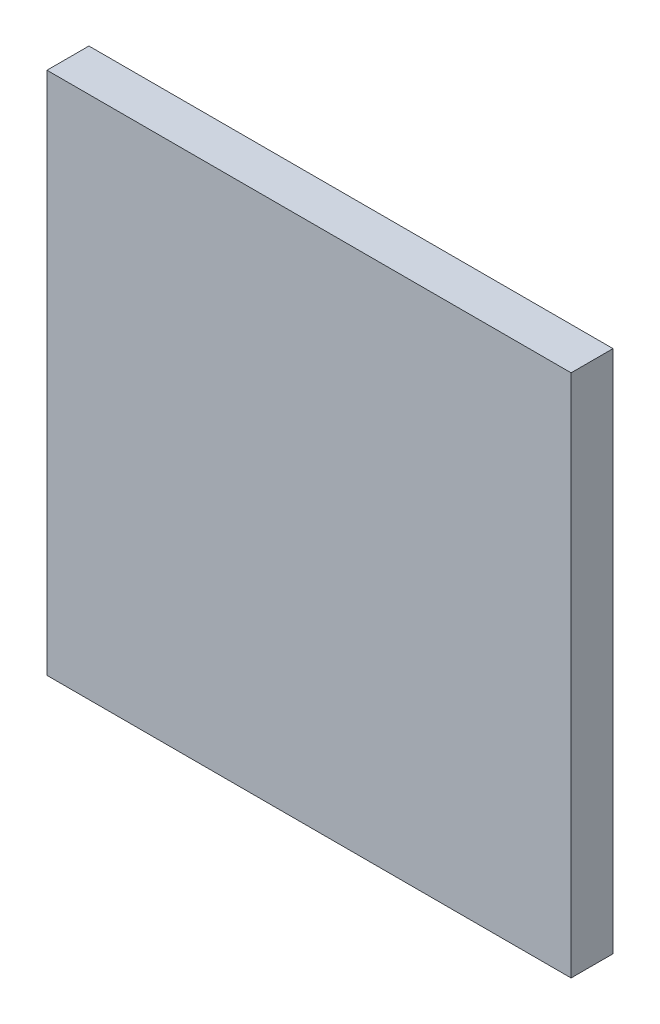
ISO-10303-21;
HEADER;
FILE_DESCRIPTION(('STEP AP214'),'2;1');
FILE_NAME('part.step','',(''),(''),'','','');
FILE_SCHEMA(('AUTOMOTIVE_DESIGN { 1 0 10303 214 1 1 1 1 }'));
ENDSEC;
DATA;
#1=APPLICATION_CONTEXT('core data for automotive mechanical design processes');
#2=APPLICATION_PROTOCOL_DEFINITION('international standard','automotive_design',2000,#1);
#3=PRODUCT_CONTEXT('',#1,'mechanical');
#4=PRODUCT('Part','Part','',(#3));
#5=PRODUCT_RELATED_PRODUCT_CATEGORY('part','',(#4));
#6=PRODUCT_DEFINITION_FORMATION('','',#4);
#7=PRODUCT_DEFINITION_CONTEXT('part definition',#1,'design');
#8=PRODUCT_DEFINITION('design','',#6,#7);
#9=PRODUCT_DEFINITION_SHAPE('','',#8);
#10=(LENGTH_UNIT() NAMED_UNIT(*) SI_UNIT(.MILLI.,.METRE.));
#11=(NAMED_UNIT(*) PLANE_ANGLE_UNIT() SI_UNIT($,.RADIAN.));
#12=(NAMED_UNIT(*) SI_UNIT($,.STERADIAN.) SOLID_ANGLE_UNIT());
#13=UNCERTAINTY_MEASURE_WITH_UNIT(LENGTH_MEASURE(1.E-05),#10,'distance_accuracy_value','');
#14=(GEOMETRIC_REPRESENTATION_CONTEXT(3) GLOBAL_UNCERTAINTY_ASSIGNED_CONTEXT((#13)) GLOBAL_UNIT_ASSIGNED_CONTEXT((#10,
#11,#12)) REPRESENTATION_CONTEXT('',''));
#15=CARTESIAN_POINT('',(0.,0.,0.));
#16=DIRECTION('',(0.,0.,1.));
#17=DIRECTION('',(1.,0.,0.));
#18=AXIS2_PLACEMENT_3D('',#15,#16,#17);
#19=CARTESIAN_POINT('',(466.617543457686,129.384302534264,4.));
#20=DIRECTION('',(0.,1.,0.));
#21=DIRECTION('',(0.,0.,1.));
#22=AXIS2_PLACEMENT_3D('',#19,#20,#21);
#23=PLANE('',#22);
#24=DIRECTION('',(1.,0.,0.));
#25=VECTOR('',#24,1.);
#26=CARTESIAN_POINT('',(466.617543457686,129.384302534264,0.));
#27=LINE('',#26,#25);
#28=CARTESIAN_POINT('',(416.617543457686,129.384302534264,0.));
#29=VERTEX_POINT('',#28);
#30=CARTESIAN_POINT('',(466.617543457686,129.384302534264,0.));
#31=VERTEX_POINT('',#30);
#32=EDGE_CURVE('E91',#29,#31,#27,.T.);
#33=ORIENTED_EDGE('',*,*,#32,.T.);
#34=DIRECTION('',(0.,0.,-1.));
#35=VECTOR('',#34,1.);
#36=CARTESIAN_POINT('',(466.617543457686,129.384302534264,4.));
#37=LINE('',#36,#35);
#38=CARTESIAN_POINT('',(466.617543457686,129.384302534264,4.));
#39=VERTEX_POINT('',#38);
#40=EDGE_CURVE('E45',#39,#31,#37,.T.);
#41=ORIENTED_EDGE('',*,*,#40,.F.);
#42=DIRECTION('',(1.,0.,0.));
#43=VECTOR('',#42,1.);
#44=CARTESIAN_POINT('',(466.617543457686,129.384302534264,4.));
#45=LINE('',#44,#43);
#46=CARTESIAN_POINT('',(416.617543457686,129.384302534264,4.));
#47=VERTEX_POINT('',#46);
#48=EDGE_CURVE('E84',#47,#39,#45,.T.);
#49=ORIENTED_EDGE('',*,*,#48,.F.);
#50=DIRECTION('',(0.,0.,-1.));
#51=VECTOR('',#50,1.);
#52=CARTESIAN_POINT('',(416.617543457686,129.384302534264,4.));
#53=LINE('',#52,#51);
#54=EDGE_CURVE('E11',#47,#29,#53,.T.);
#55=ORIENTED_EDGE('',*,*,#54,.T.);
#56=EDGE_LOOP('',(#33,#41,#49,#55));
#57=FACE_BOUND('',#56,.T.);
#58=ADVANCED_FACE('F37',(#57),#23,.F.);
#59=CARTESIAN_POINT('',(466.617543457686,179.384302534264,4.));
#60=DIRECTION('',(-1.,0.,0.));
#61=DIRECTION('',(0.,0.,1.));
#62=AXIS2_PLACEMENT_3D('',#59,#60,#61);
#63=PLANE('',#62);
#64=DIRECTION('',(0.,1.,0.));
#65=VECTOR('',#64,1.);
#66=CARTESIAN_POINT('',(466.617543457686,179.384302534264,0.));
#67=LINE('',#66,#65);
#68=CARTESIAN_POINT('',(466.617543457686,179.384302534264,0.));
#69=VERTEX_POINT('',#68);
#70=EDGE_CURVE('E71',#31,#69,#67,.T.);
#71=ORIENTED_EDGE('',*,*,#70,.T.);
#72=DIRECTION('',(0.,0.,-1.));
#73=VECTOR('',#72,1.);
#74=CARTESIAN_POINT('',(466.617543457686,179.384302534264,4.));
#75=LINE('',#74,#73);
#76=CARTESIAN_POINT('',(466.617543457686,179.384302534264,4.));
#77=VERTEX_POINT('',#76);
#78=EDGE_CURVE('E92',#77,#69,#75,.T.);
#79=ORIENTED_EDGE('',*,*,#78,.F.);
#80=DIRECTION('',(0.,1.,0.));
#81=VECTOR('',#80,1.);
#82=CARTESIAN_POINT('',(466.617543457686,179.384302534264,4.));
#83=LINE('',#82,#81);
#84=EDGE_CURVE('E88',#39,#77,#83,.T.);
#85=ORIENTED_EDGE('',*,*,#84,.F.);
#86=ORIENTED_EDGE('',*,*,#40,.T.);
#87=EDGE_LOOP('',(#71,#79,#85,#86));
#88=FACE_BOUND('',#87,.T.);
#89=ADVANCED_FACE('F93',(#88),#63,.F.);
#90=CARTESIAN_POINT('',(416.617543457686,179.384302534264,4.));
#91=DIRECTION('',(0.,-1.,0.));
#92=DIRECTION('',(0.,0.,-1.));
#93=AXIS2_PLACEMENT_3D('',#90,#91,#92);
#94=PLANE('',#93);
#95=DIRECTION('',(-1.,0.,0.));
#96=VECTOR('',#95,1.);
#97=CARTESIAN_POINT('',(416.617543457686,179.384302534264,0.));
#98=LINE('',#97,#96);
#99=CARTESIAN_POINT('',(416.617543457686,179.384302534264,0.));
#100=VERTEX_POINT('',#99);
#101=EDGE_CURVE('E78',#69,#100,#98,.T.);
#102=ORIENTED_EDGE('',*,*,#101,.T.);
#103=DIRECTION('',(0.,0.,-1.));
#104=VECTOR('',#103,1.);
#105=CARTESIAN_POINT('',(416.617543457686,179.384302534264,4.));
#106=LINE('',#105,#104);
#107=CARTESIAN_POINT('',(416.617543457686,179.384302534264,4.));
#108=VERTEX_POINT('',#107);
#109=EDGE_CURVE('E97',#108,#100,#106,.T.);
#110=ORIENTED_EDGE('',*,*,#109,.F.);
#111=DIRECTION('',(-1.,0.,0.));
#112=VECTOR('',#111,1.);
#113=CARTESIAN_POINT('',(416.617543457686,179.384302534264,4.));
#114=LINE('',#113,#112);
#115=EDGE_CURVE('E95',#77,#108,#114,.T.);
#116=ORIENTED_EDGE('',*,*,#115,.F.);
#117=ORIENTED_EDGE('',*,*,#78,.T.);
#118=EDGE_LOOP('',(#102,#110,#116,#117));
#119=FACE_BOUND('',#118,.T.);
#120=ADVANCED_FACE('F107',(#119),#94,.F.);
#121=CARTESIAN_POINT('',(416.617543457686,154.384302534264,4.));
#122=DIRECTION('',(1.,0.,0.));
#123=DIRECTION('',(0.,0.,-1.));
#124=AXIS2_PLACEMENT_3D('',#121,#122,#123);
#125=PLANE('',#124);
#126=DIRECTION('',(0.,-1.,0.));
#127=VECTOR('',#126,1.);
#128=CARTESIAN_POINT('',(416.617543457686,154.384302534264,0.));
#129=LINE('',#128,#127);
#130=EDGE_CURVE('E104',#100,#29,#129,.T.);
#131=ORIENTED_EDGE('',*,*,#130,.T.);
#132=ORIENTED_EDGE('',*,*,#54,.F.);
#133=DIRECTION('',(0.,-1.,0.));
#134=VECTOR('',#133,1.);
#135=CARTESIAN_POINT('',(416.617543457686,129.384302534264,4.));
#136=LINE('',#135,#134);
#137=EDGE_CURVE('E53',#108,#47,#136,.T.);
#138=ORIENTED_EDGE('',*,*,#137,.F.);
#139=ORIENTED_EDGE('',*,*,#109,.T.);
#140=EDGE_LOOP('',(#131,#132,#138,#139));
#141=FACE_BOUND('',#140,.T.);
#142=ADVANCED_FACE('F111',(#141),#125,.F.);
#143=CARTESIAN_POINT('',(0.,0.,4.));
#144=DIRECTION('',(0.,0.,-1.));
#145=DIRECTION('',(-1.,0.,0.));
#146=AXIS2_PLACEMENT_3D('',#143,#144,#145);
#147=PLANE('',#146);
#148=ORIENTED_EDGE('',*,*,#137,.T.);
#149=ORIENTED_EDGE('',*,*,#48,.T.);
#150=ORIENTED_EDGE('',*,*,#84,.T.);
#151=ORIENTED_EDGE('',*,*,#115,.T.);
#152=EDGE_LOOP('',(#148,#149,#150,#151));
#153=FACE_BOUND('',#152,.T.);
#154=ADVANCED_FACE('F86',(#153),#147,.F.);
#155=CARTESIAN_POINT('',(0.,0.,0.));
#156=DIRECTION('',(0.,0.,-1.));
#157=DIRECTION('',(-1.,0.,0.));
#158=AXIS2_PLACEMENT_3D('',#155,#156,#157);
#159=PLANE('',#158);
#160=ORIENTED_EDGE('',*,*,#32,.F.);
#161=ORIENTED_EDGE('',*,*,#130,.F.);
#162=ORIENTED_EDGE('',*,*,#101,.F.);
#163=ORIENTED_EDGE('',*,*,#70,.F.);
#164=EDGE_LOOP('',(#160,#161,#162,#163));
#165=FACE_BOUND('',#164,.T.);
#166=ADVANCED_FACE('F110',(#165),#159,.T.);
#167=CLOSED_SHELL('',(#58,#89,#120,#142,#154,#166));
#168=MANIFOLD_SOLID_BREP('B2',#167);
#169=ADVANCED_BREP_SHAPE_REPRESENTATION('',(#18,#168),#14);
#170=SHAPE_DEFINITION_REPRESENTATION(#9,#169);
ENDSEC;
END-ISO-10303-21;
